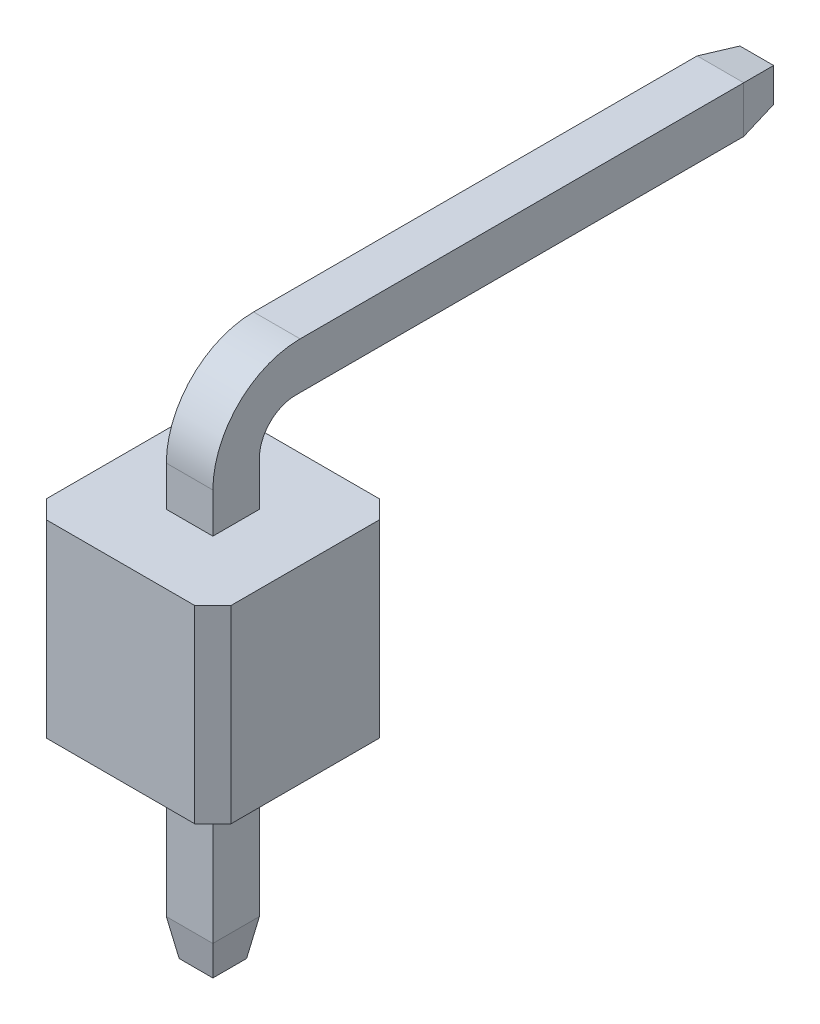
ISO-10303-21;
HEADER;
FILE_DESCRIPTION(('STEP AP214'),'2;1');
FILE_NAME('part.step','',(''),(''),'','','');
FILE_SCHEMA(('AUTOMOTIVE_DESIGN { 1 0 10303 214 1 1 1 1 }'));
ENDSEC;
DATA;
#1=APPLICATION_CONTEXT('core data for automotive mechanical design processes');
#2=APPLICATION_PROTOCOL_DEFINITION('international standard','automotive_design',2000,#1);
#3=PRODUCT_CONTEXT('',#1,'mechanical');
#4=PRODUCT('Part','Part','',(#3));
#5=PRODUCT_RELATED_PRODUCT_CATEGORY('part','',(#4));
#6=PRODUCT_DEFINITION_FORMATION('','',#4);
#7=PRODUCT_DEFINITION_CONTEXT('part definition',#1,'design');
#8=PRODUCT_DEFINITION('design','',#6,#7);
#9=PRODUCT_DEFINITION_SHAPE('','',#8);
#10=(LENGTH_UNIT() NAMED_UNIT(*) SI_UNIT(.MILLI.,.METRE.));
#11=(NAMED_UNIT(*) PLANE_ANGLE_UNIT() SI_UNIT($,.RADIAN.));
#12=(NAMED_UNIT(*) SI_UNIT($,.STERADIAN.) SOLID_ANGLE_UNIT());
#13=UNCERTAINTY_MEASURE_WITH_UNIT(LENGTH_MEASURE(1.E-05),#10,'distance_accuracy_value','');
#14=(GEOMETRIC_REPRESENTATION_CONTEXT(3) GLOBAL_UNCERTAINTY_ASSIGNED_CONTEXT((#13)) GLOBAL_UNIT_ASSIGNED_CONTEXT((#10,
#11,#12)) REPRESENTATION_CONTEXT('',''));
#15=CARTESIAN_POINT('',(0.,0.,0.));
#16=DIRECTION('',(0.,0.,1.));
#17=DIRECTION('',(1.,0.,0.));
#18=AXIS2_PLACEMENT_3D('',#15,#16,#17);
#19=CARTESIAN_POINT('',(0.,2.6,1.27));
#20=DIRECTION('',(0.,0.,-1.));
#21=DIRECTION('',(-1.,0.,0.));
#22=AXIS2_PLACEMENT_3D('',#19,#20,#21);
#23=PLANE('',#22);
#24=DIRECTION('',(1.,0.,0.));
#25=VECTOR('',#24,1.);
#26=CARTESIAN_POINT('',(0.,2.6,1.27));
#27=LINE('',#26,#25);
#28=CARTESIAN_POINT('',(-1.02,2.6,1.27));
#29=VERTEX_POINT('',#28);
#30=CARTESIAN_POINT('',(1.02,2.6,1.27));
#31=VERTEX_POINT('',#30);
#32=EDGE_CURVE('P0_E153',#29,#31,#27,.T.);
#33=ORIENTED_EDGE('',*,*,#32,.F.);
#34=DIRECTION('',(0.,-1.,0.));
#35=VECTOR('',#34,1.);
#36=CARTESIAN_POINT('',(-1.02,0.,1.27));
#37=LINE('',#36,#35);
#38=CARTESIAN_POINT('',(-1.02,0.,1.27));
#39=VERTEX_POINT('',#38);
#40=EDGE_CURVE('P0_E209',#29,#39,#37,.T.);
#41=ORIENTED_EDGE('',*,*,#40,.T.);
#42=DIRECTION('',(1.,0.,0.));
#43=VECTOR('',#42,1.);
#44=CARTESIAN_POINT('',(0.,0.,1.27));
#45=LINE('',#44,#43);
#46=CARTESIAN_POINT('',(1.02,0.,1.27));
#47=VERTEX_POINT('',#46);
#48=EDGE_CURVE('P0_E166',#39,#47,#45,.T.);
#49=ORIENTED_EDGE('',*,*,#48,.T.);
#50=DIRECTION('',(0.,1.,0.));
#51=VECTOR('',#50,1.);
#52=CARTESIAN_POINT('',(1.02,2.6,1.27));
#53=LINE('',#52,#51);
#54=EDGE_CURVE('P0_E207',#47,#31,#53,.T.);
#55=ORIENTED_EDGE('',*,*,#54,.T.);
#56=EDGE_LOOP('',(#33,#41,#49,#55));
#57=FACE_BOUND('',#56,.T.);
#58=ADVANCED_FACE('P0_F17',(#57),#23,.F.);
#59=CARTESIAN_POINT('',(1.27,2.6,0.));
#60=DIRECTION('',(-1.,0.,0.));
#61=DIRECTION('',(0.,0.,1.));
#62=AXIS2_PLACEMENT_3D('',#59,#60,#61);
#63=PLANE('',#62);
#64=DIRECTION('',(0.,0.,-1.));
#65=VECTOR('',#64,1.);
#66=CARTESIAN_POINT('',(1.27,0.,0.));
#67=LINE('',#66,#65);
#68=CARTESIAN_POINT('',(1.27,0.,1.02));
#69=VERTEX_POINT('',#68);
#70=CARTESIAN_POINT('',(1.27,0.,-1.02));
#71=VERTEX_POINT('',#70);
#72=EDGE_CURVE('P0_E169',#69,#71,#67,.T.);
#73=ORIENTED_EDGE('',*,*,#72,.T.);
#74=DIRECTION('',(0.,1.,0.));
#75=VECTOR('',#74,1.);
#76=CARTESIAN_POINT('',(1.27,2.6,-1.02));
#77=LINE('',#76,#75);
#78=CARTESIAN_POINT('',(1.27,2.6,-1.02));
#79=VERTEX_POINT('',#78);
#80=EDGE_CURVE('P0_E193',#71,#79,#77,.T.);
#81=ORIENTED_EDGE('',*,*,#80,.T.);
#82=DIRECTION('',(0.,0.,-1.));
#83=VECTOR('',#82,1.);
#84=CARTESIAN_POINT('',(1.27,2.6,0.));
#85=LINE('',#84,#83);
#86=CARTESIAN_POINT('',(1.27,2.6,1.02));
#87=VERTEX_POINT('',#86);
#88=EDGE_CURVE('P0_E156',#87,#79,#85,.T.);
#89=ORIENTED_EDGE('',*,*,#88,.F.);
#90=DIRECTION('',(0.,-1.,0.));
#91=VECTOR('',#90,1.);
#92=CARTESIAN_POINT('',(1.27,2.6,1.02));
#93=LINE('',#92,#91);
#94=EDGE_CURVE('P0_E190',#87,#69,#93,.T.);
#95=ORIENTED_EDGE('',*,*,#94,.T.);
#96=EDGE_LOOP('',(#73,#81,#89,#95));
#97=FACE_BOUND('',#96,.T.);
#98=ADVANCED_FACE('P0_F266',(#97),#63,.F.);
#99=CARTESIAN_POINT('',(0.,2.6,-1.27));
#100=DIRECTION('',(0.,0.,-1.));
#101=DIRECTION('',(-1.,0.,0.));
#102=AXIS2_PLACEMENT_3D('',#99,#100,#101);
#103=PLANE('',#102);
#104=DIRECTION('',(1.,0.,0.));
#105=VECTOR('',#104,1.);
#106=CARTESIAN_POINT('',(0.,2.6,-1.27));
#107=LINE('',#106,#105);
#108=CARTESIAN_POINT('',(-1.02,2.6,-1.27));
#109=VERTEX_POINT('',#108);
#110=CARTESIAN_POINT('',(1.02,2.6,-1.27));
#111=VERTEX_POINT('',#110);
#112=EDGE_CURVE('P0_E160',#109,#111,#107,.T.);
#113=ORIENTED_EDGE('',*,*,#112,.T.);
#114=DIRECTION('',(0.,-1.,0.));
#115=VECTOR('',#114,1.);
#116=CARTESIAN_POINT('',(1.02,0.,-1.27));
#117=LINE('',#116,#115);
#118=CARTESIAN_POINT('',(1.02,0.,-1.27));
#119=VERTEX_POINT('',#118);
#120=EDGE_CURVE('P0_E179',#111,#119,#117,.T.);
#121=ORIENTED_EDGE('',*,*,#120,.T.);
#122=DIRECTION('',(1.,0.,0.));
#123=VECTOR('',#122,1.);
#124=CARTESIAN_POINT('',(0.,0.,-1.27));
#125=LINE('',#124,#123);
#126=CARTESIAN_POINT('',(-1.02,0.,-1.27));
#127=VERTEX_POINT('',#126);
#128=EDGE_CURVE('P0_E173',#127,#119,#125,.T.);
#129=ORIENTED_EDGE('',*,*,#128,.F.);
#130=DIRECTION('',(0.,1.,0.));
#131=VECTOR('',#130,1.);
#132=CARTESIAN_POINT('',(-1.02,2.6,-1.27));
#133=LINE('',#132,#131);
#134=EDGE_CURVE('P0_E165',#127,#109,#133,.T.);
#135=ORIENTED_EDGE('',*,*,#134,.T.);
#136=EDGE_LOOP('',(#113,#121,#129,#135));
#137=FACE_BOUND('',#136,.T.);
#138=ADVANCED_FACE('P0_F272',(#137),#103,.T.);
#139=CARTESIAN_POINT('',(-1.27,2.6,0.));
#140=DIRECTION('',(-1.,0.,0.));
#141=DIRECTION('',(0.,0.,1.));
#142=AXIS2_PLACEMENT_3D('',#139,#140,#141);
#143=PLANE('',#142);
#144=DIRECTION('',(0.,0.,-1.));
#145=VECTOR('',#144,1.);
#146=CARTESIAN_POINT('',(-1.27,2.6,0.));
#147=LINE('',#146,#145);
#148=CARTESIAN_POINT('',(-1.27,2.6,1.02));
#149=VERTEX_POINT('',#148);
#150=CARTESIAN_POINT('',(-1.27,2.6,-1.02));
#151=VERTEX_POINT('',#150);
#152=EDGE_CURVE('P0_E163',#149,#151,#147,.T.);
#153=ORIENTED_EDGE('',*,*,#152,.T.);
#154=DIRECTION('',(0.,-1.,0.));
#155=VECTOR('',#154,1.);
#156=CARTESIAN_POINT('',(-1.27,2.6,-1.02));
#157=LINE('',#156,#155);
#158=CARTESIAN_POINT('',(-1.27,0.,-1.02));
#159=VERTEX_POINT('',#158);
#160=EDGE_CURVE('P0_E204',#151,#159,#157,.T.);
#161=ORIENTED_EDGE('',*,*,#160,.T.);
#162=DIRECTION('',(0.,0.,-1.));
#163=VECTOR('',#162,1.);
#164=CARTESIAN_POINT('',(-1.27,0.,0.));
#165=LINE('',#164,#163);
#166=CARTESIAN_POINT('',(-1.27,0.,1.02));
#167=VERTEX_POINT('',#166);
#168=EDGE_CURVE('P0_E157',#167,#159,#165,.T.);
#169=ORIENTED_EDGE('',*,*,#168,.F.);
#170=DIRECTION('',(0.,1.,0.));
#171=VECTOR('',#170,1.);
#172=CARTESIAN_POINT('',(-1.27,2.6,1.02));
#173=LINE('',#172,#171);
#174=EDGE_CURVE('P0_E202',#167,#149,#173,.T.);
#175=ORIENTED_EDGE('',*,*,#174,.T.);
#176=EDGE_LOOP('',(#153,#161,#169,#175));
#177=FACE_BOUND('',#176,.T.);
#178=ADVANCED_FACE('P0_F311',(#177),#143,.T.);
#179=CARTESIAN_POINT('',(0.,2.6,0.));
#180=DIRECTION('',(0.,1.,0.));
#181=DIRECTION('',(0.,0.,1.));
#182=AXIS2_PLACEMENT_3D('',#179,#180,#181);
#183=PLANE('',#182);
#184=ORIENTED_EDGE('',*,*,#88,.T.);
#185=DIRECTION('',(-0.707106781186546,0.,-0.707106781186549));
#186=VECTOR('',#185,1.);
#187=CARTESIAN_POINT('',(1.145,2.6,-1.145));
#188=LINE('',#187,#186);
#189=EDGE_CURVE('P0_E200',#79,#111,#188,.T.);
#190=ORIENTED_EDGE('',*,*,#189,.T.);
#191=ORIENTED_EDGE('',*,*,#112,.F.);
#192=DIRECTION('',(0.707106781186549,0.,-0.707106781186546));
#193=VECTOR('',#192,1.);
#194=CARTESIAN_POINT('',(-1.145,2.6,-1.145));
#195=LINE('',#194,#193);
#196=EDGE_CURVE('P0_E40',#109,#151,#195,.F.);
#197=ORIENTED_EDGE('',*,*,#196,.T.);
#198=ORIENTED_EDGE('',*,*,#152,.F.);
#199=DIRECTION('',(0.707106781186546,0.,0.707106781186549));
#200=VECTOR('',#199,1.);
#201=CARTESIAN_POINT('',(-1.145,2.6,1.145));
#202=LINE('',#201,#200);
#203=EDGE_CURVE('P0_E197',#149,#29,#202,.T.);
#204=ORIENTED_EDGE('',*,*,#203,.T.);
#205=ORIENTED_EDGE('',*,*,#32,.T.);
#206=DIRECTION('',(-0.707106781186549,0.,0.707106781186546));
#207=VECTOR('',#206,1.);
#208=CARTESIAN_POINT('',(1.145,2.6,1.145));
#209=LINE('',#208,#207);
#210=EDGE_CURVE('P0_E195',#31,#87,#209,.F.);
#211=ORIENTED_EDGE('',*,*,#210,.T.);
#212=EDGE_LOOP('',(#184,#190,#191,#197,#198,#204,#205,#211));
#213=FACE_BOUND('',#212,.T.);
#214=ADVANCED_FACE('P0_F295',(#213),#183,.T.);
#215=CARTESIAN_POINT('',(0.,0.,0.));
#216=DIRECTION('',(0.,1.,0.));
#217=DIRECTION('',(0.,0.,1.));
#218=AXIS2_PLACEMENT_3D('',#215,#216,#217);
#219=PLANE('',#218);
#220=DIRECTION('',(0.,0.,-1.));
#221=VECTOR('',#220,1.);
#222=CARTESIAN_POINT('',(-0.32,0.,0.));
#223=LINE('',#222,#221);
#224=CARTESIAN_POINT('',(-0.32,0.,0.32));
#225=VERTEX_POINT('',#224);
#226=CARTESIAN_POINT('',(-0.32,0.,-0.32));
#227=VERTEX_POINT('',#226);
#228=EDGE_CURVE('P0_E25',#225,#227,#223,.T.);
#229=ORIENTED_EDGE('',*,*,#228,.F.);
#230=DIRECTION('',(1.,0.,0.));
#231=VECTOR('',#230,1.);
#232=CARTESIAN_POINT('',(0.,0.,0.32));
#233=LINE('',#232,#231);
#234=CARTESIAN_POINT('',(0.32,0.,0.32));
#235=VERTEX_POINT('',#234);
#236=EDGE_CURVE('P0_E11',#225,#235,#233,.T.);
#237=ORIENTED_EDGE('',*,*,#236,.T.);
#238=DIRECTION('',(0.,0.,-1.));
#239=VECTOR('',#238,1.);
#240=CARTESIAN_POINT('',(0.32,0.,0.));
#241=LINE('',#240,#239);
#242=CARTESIAN_POINT('',(0.32,0.,-0.32));
#243=VERTEX_POINT('',#242);
#244=EDGE_CURVE('P0_E212',#235,#243,#241,.T.);
#245=ORIENTED_EDGE('',*,*,#244,.T.);
#246=DIRECTION('',(1.,0.,0.));
#247=VECTOR('',#246,1.);
#248=CARTESIAN_POINT('',(0.,0.,-0.32));
#249=LINE('',#248,#247);
#250=EDGE_CURVE('P0_E215',#227,#243,#249,.T.);
#251=ORIENTED_EDGE('',*,*,#250,.F.);
#252=EDGE_LOOP('',(#229,#237,#245,#251));
#253=FACE_BOUND('',#252,.T.);
#254=ORIENTED_EDGE('',*,*,#128,.T.);
#255=DIRECTION('',(0.707106781186546,0.,0.707106781186549));
#256=VECTOR('',#255,1.);
#257=CARTESIAN_POINT('',(1.02,0.,-1.27));
#258=LINE('',#257,#256);
#259=EDGE_CURVE('P0_E188',#119,#71,#258,.T.);
#260=ORIENTED_EDGE('',*,*,#259,.T.);
#261=ORIENTED_EDGE('',*,*,#72,.F.);
#262=DIRECTION('',(0.707106781186549,0.,-0.707106781186546));
#263=VECTOR('',#262,1.);
#264=CARTESIAN_POINT('',(1.27,0.,1.02));
#265=LINE('',#264,#263);
#266=EDGE_CURVE('P0_E182',#69,#47,#265,.F.);
#267=ORIENTED_EDGE('',*,*,#266,.T.);
#268=ORIENTED_EDGE('',*,*,#48,.F.);
#269=DIRECTION('',(-0.707106781186546,0.,-0.707106781186549));
#270=VECTOR('',#269,1.);
#271=CARTESIAN_POINT('',(-1.02,0.,1.27));
#272=LINE('',#271,#270);
#273=EDGE_CURVE('P0_E184',#39,#167,#272,.T.);
#274=ORIENTED_EDGE('',*,*,#273,.T.);
#275=ORIENTED_EDGE('',*,*,#168,.T.);
#276=DIRECTION('',(-0.707106781186549,0.,0.707106781186546));
#277=VECTOR('',#276,1.);
#278=CARTESIAN_POINT('',(-1.27,0.,-1.02));
#279=LINE('',#278,#277);
#280=EDGE_CURVE('P0_E186',#159,#127,#279,.F.);
#281=ORIENTED_EDGE('',*,*,#280,.T.);
#282=EDGE_LOOP('',(#254,#260,#261,#267,#268,#274,#275,#281));
#283=FACE_BOUND('',#282,.T.);
#284=ADVANCED_FACE('P0_F232',(#253,#283),#219,.F.);
#285=CARTESIAN_POINT('',(1.02,2.6,-1.27));
#286=DIRECTION('',(0.707106781186549,0.,-0.707106781186546));
#287=DIRECTION('',(0.,1.,0.));
#288=AXIS2_PLACEMENT_3D('',#285,#286,#287);
#289=PLANE('',#288);
#290=ORIENTED_EDGE('',*,*,#189,.F.);
#291=ORIENTED_EDGE('',*,*,#80,.F.);
#292=ORIENTED_EDGE('',*,*,#259,.F.);
#293=ORIENTED_EDGE('',*,*,#120,.F.);
#294=EDGE_LOOP('',(#290,#291,#292,#293));
#295=FACE_BOUND('',#294,.T.);
#296=ADVANCED_FACE('P0_F278',(#295),#289,.T.);
#297=CARTESIAN_POINT('',(-1.27,2.6,-1.02));
#298=DIRECTION('',(0.707106781186546,0.,0.707106781186549));
#299=DIRECTION('',(0.,-1.,0.));
#300=AXIS2_PLACEMENT_3D('',#297,#298,#299);
#301=PLANE('',#300);
#302=ORIENTED_EDGE('',*,*,#196,.F.);
#303=ORIENTED_EDGE('',*,*,#134,.F.);
#304=ORIENTED_EDGE('',*,*,#280,.F.);
#305=ORIENTED_EDGE('',*,*,#160,.F.);
#306=EDGE_LOOP('',(#302,#303,#304,#305));
#307=FACE_BOUND('',#306,.T.);
#308=ADVANCED_FACE('P0_F281',(#307),#301,.F.);
#309=CARTESIAN_POINT('',(-1.02,2.6,1.27));
#310=DIRECTION('',(-0.707106781186549,0.,0.707106781186546));
#311=DIRECTION('',(0.,1.,0.));
#312=AXIS2_PLACEMENT_3D('',#309,#310,#311);
#313=PLANE('',#312);
#314=ORIENTED_EDGE('',*,*,#203,.F.);
#315=ORIENTED_EDGE('',*,*,#174,.F.);
#316=ORIENTED_EDGE('',*,*,#273,.F.);
#317=ORIENTED_EDGE('',*,*,#40,.F.);
#318=EDGE_LOOP('',(#314,#315,#316,#317));
#319=FACE_BOUND('',#318,.T.);
#320=ADVANCED_FACE('P0_F284',(#319),#313,.T.);
#321=CARTESIAN_POINT('',(1.27,2.6,1.02));
#322=DIRECTION('',(-0.707106781186546,0.,-0.707106781186549));
#323=DIRECTION('',(0.,-1.,0.));
#324=AXIS2_PLACEMENT_3D('',#321,#322,#323);
#325=PLANE('',#324);
#326=ORIENTED_EDGE('',*,*,#210,.F.);
#327=ORIENTED_EDGE('',*,*,#54,.F.);
#328=ORIENTED_EDGE('',*,*,#266,.F.);
#329=ORIENTED_EDGE('',*,*,#94,.F.);
#330=EDGE_LOOP('',(#326,#327,#328,#329));
#331=FACE_BOUND('',#330,.T.);
#332=ADVANCED_FACE('P0_F19',(#331),#325,.F.);
#333=CARTESIAN_POINT('',(0.,-2.75,0.));
#334=DIRECTION('',(0.,1.,0.));
#335=DIRECTION('',(0.,0.,1.));
#336=AXIS2_PLACEMENT_3D('',#333,#334,#335);
#337=PLANE('',#336);
#338=DIRECTION('',(0.,0.,-1.));
#339=VECTOR('',#338,1.);
#340=CARTESIAN_POINT('',(-0.231836509645768,-2.75,0.));
#341=LINE('',#340,#339);
#342=CARTESIAN_POINT('',(-0.231836509645768,-2.75,0.231836509645769));
#343=VERTEX_POINT('',#342);
#344=CARTESIAN_POINT('',(-0.231836509645768,-2.75,-0.231836509645766));
#345=VERTEX_POINT('',#344);
#346=EDGE_CURVE('P0_E130',#343,#345,#341,.T.);
#347=ORIENTED_EDGE('',*,*,#346,.T.);
#348=DIRECTION('',(1.,0.,0.));
#349=VECTOR('',#348,1.);
#350=CARTESIAN_POINT('',(0.,-2.75,-0.231836509645766));
#351=LINE('',#350,#349);
#352=CARTESIAN_POINT('',(0.231836509645768,-2.75,-0.231836509645766));
#353=VERTEX_POINT('',#352);
#354=EDGE_CURVE('P0_E126',#345,#353,#351,.T.);
#355=ORIENTED_EDGE('',*,*,#354,.T.);
#356=DIRECTION('',(0.,0.,1.));
#357=VECTOR('',#356,1.);
#358=CARTESIAN_POINT('',(0.231836509645768,-2.75,0.32));
#359=LINE('',#358,#357);
#360=CARTESIAN_POINT('',(0.231836509645768,-2.75,0.231836509645769));
#361=VERTEX_POINT('',#360);
#362=EDGE_CURVE('P0_E120',#353,#361,#359,.T.);
#363=ORIENTED_EDGE('',*,*,#362,.T.);
#364=DIRECTION('',(-1.,0.,0.));
#365=VECTOR('',#364,1.);
#366=CARTESIAN_POINT('',(-0.32,-2.75,0.231836509645769));
#367=LINE('',#366,#365);
#368=EDGE_CURVE('P0_E123',#361,#343,#367,.T.);
#369=ORIENTED_EDGE('',*,*,#368,.T.);
#370=EDGE_LOOP('',(#347,#355,#363,#369));
#371=FACE_BOUND('',#370,.T.);
#372=ADVANCED_FACE('P0_F122',(#371),#337,.F.);
#373=CARTESIAN_POINT('',(-0.32,-2.25,0.32));
#374=DIRECTION('',(0.,-0.173648177666927,0.984807753012209));
#375=DIRECTION('',(-1.,0.,0.));
#376=AXIS2_PLACEMENT_3D('',#373,#374,#375);
#377=PLANE('',#376);
#378=DIRECTION('',(0.171087869746033,0.970287525247815,0.171087869746033));
#379=VECTOR('',#378,1.);
#380=CARTESIAN_POINT('',(0.301266522128489,-2.35624283247091,0.30126652212849));
#381=LINE('',#380,#379);
#382=CARTESIAN_POINT('',(0.32,-2.25,0.32));
#383=VERTEX_POINT('',#382);
#384=EDGE_CURVE('P0_E136',#383,#361,#381,.F.);
#385=ORIENTED_EDGE('',*,*,#384,.F.);
#386=DIRECTION('',(1.,0.,0.));
#387=VECTOR('',#386,1.);
#388=CARTESIAN_POINT('',(0.32,-2.25,0.32));
#389=LINE('',#388,#387);
#390=CARTESIAN_POINT('',(-0.32,-2.25,0.32));
#391=VERTEX_POINT('',#390);
#392=EDGE_CURVE('P0_E170',#391,#383,#389,.T.);
#393=ORIENTED_EDGE('',*,*,#392,.F.);
#394=DIRECTION('',(-0.171087869746033,0.970287525247815,0.171087869746033));
#395=VECTOR('',#394,1.);
#396=CARTESIAN_POINT('',(-0.32,-2.25,0.32));
#397=LINE('',#396,#395);
#398=EDGE_CURVE('P0_E139',#343,#391,#397,.T.);
#399=ORIENTED_EDGE('',*,*,#398,.F.);
#400=ORIENTED_EDGE('',*,*,#368,.F.);
#401=EDGE_LOOP('',(#385,#393,#399,#400));
#402=FACE_BOUND('',#401,.T.);
#403=ADVANCED_FACE('P0_F134',(#402),#377,.T.);
#404=CARTESIAN_POINT('',(-0.231836509645768,-2.75,0.));
#405=DIRECTION('',(0.984807753012209,0.173648177666927,0.));
#406=DIRECTION('',(0.,0.,-1.));
#407=AXIS2_PLACEMENT_3D('',#404,#405,#406);
#408=PLANE('',#407);
#409=ORIENTED_EDGE('',*,*,#398,.T.);
#410=DIRECTION('',(0.,0.,1.));
#411=VECTOR('',#410,1.);
#412=CARTESIAN_POINT('',(-0.32,-2.25,0.32));
#413=LINE('',#412,#411);
#414=CARTESIAN_POINT('',(-0.32,-2.25,-0.32));
#415=VERTEX_POINT('',#414);
#416=EDGE_CURVE('P0_E246',#415,#391,#413,.T.);
#417=ORIENTED_EDGE('',*,*,#416,.F.);
#418=DIRECTION('',(0.171087869746033,-0.970287525247815,0.171087869746033));
#419=VECTOR('',#418,1.);
#420=CARTESIAN_POINT('',(-0.225050409453179,-2.78848588664833,-0.225050409453178));
#421=LINE('',#420,#419);
#422=EDGE_CURVE('P0_E145',#345,#415,#421,.F.);
#423=ORIENTED_EDGE('',*,*,#422,.F.);
#424=ORIENTED_EDGE('',*,*,#346,.F.);
#425=EDGE_LOOP('',(#409,#417,#423,#424));
#426=FACE_BOUND('',#425,.T.);
#427=ADVANCED_FACE('P0_F253',(#426),#408,.F.);
#428=CARTESIAN_POINT('',(0.,-2.75,-0.231836509645766));
#429=DIRECTION('',(0.,0.173648177666927,0.984807753012209));
#430=DIRECTION('',(1.,0.,0.));
#431=AXIS2_PLACEMENT_3D('',#428,#429,#430);
#432=PLANE('',#431);
#433=ORIENTED_EDGE('',*,*,#422,.T.);
#434=DIRECTION('',(-1.,0.,0.));
#435=VECTOR('',#434,1.);
#436=CARTESIAN_POINT('',(-0.32,-2.25,-0.32));
#437=LINE('',#436,#435);
#438=CARTESIAN_POINT('',(0.32,-2.25,-0.32));
#439=VERTEX_POINT('',#438);
#440=EDGE_CURVE('P0_E230',#439,#415,#437,.T.);
#441=ORIENTED_EDGE('',*,*,#440,.F.);
#442=DIRECTION('',(-0.171087869746033,-0.970287525247815,0.171087869746033));
#443=VECTOR('',#442,1.);
#444=CARTESIAN_POINT('',(0.301266522128489,-2.35624283247091,-0.301266522128488));
#445=LINE('',#444,#443);
#446=EDGE_CURVE('P0_E149',#439,#353,#445,.T.);
#447=ORIENTED_EDGE('',*,*,#446,.T.);
#448=ORIENTED_EDGE('',*,*,#354,.F.);
#449=EDGE_LOOP('',(#433,#441,#447,#448));
#450=FACE_BOUND('',#449,.T.);
#451=ADVANCED_FACE('P0_F249',(#450),#432,.F.);
#452=CARTESIAN_POINT('',(0.32,-2.25,0.32));
#453=DIRECTION('',(0.984807753012209,-0.173648177666927,0.));
#454=DIRECTION('',(0.,0.,1.));
#455=AXIS2_PLACEMENT_3D('',#452,#453,#454);
#456=PLANE('',#455);
#457=ORIENTED_EDGE('',*,*,#384,.T.);
#458=ORIENTED_EDGE('',*,*,#362,.F.);
#459=ORIENTED_EDGE('',*,*,#446,.F.);
#460=DIRECTION('',(0.,0.,-1.));
#461=VECTOR('',#460,1.);
#462=CARTESIAN_POINT('',(0.32,-2.25,-0.32));
#463=LINE('',#462,#461);
#464=EDGE_CURVE('P0_E144',#383,#439,#463,.T.);
#465=ORIENTED_EDGE('',*,*,#464,.F.);
#466=EDGE_LOOP('',(#457,#458,#459,#465));
#467=FACE_BOUND('',#466,.T.);
#468=ADVANCED_FACE('P0_F143',(#467),#456,.T.);
#469=CARTESIAN_POINT('',(0.32,-2.75,0.32));
#470=DIRECTION('',(1.,0.,0.));
#471=DIRECTION('',(0.,0.,-1.));
#472=AXIS2_PLACEMENT_3D('',#469,#470,#471);
#473=PLANE('',#472);
#474=ORIENTED_EDGE('',*,*,#244,.F.);
#475=DIRECTION('',(0.,1.,0.));
#476=VECTOR('',#475,1.);
#477=CARTESIAN_POINT('',(0.32,-2.75,0.32));
#478=LINE('',#477,#476);
#479=EDGE_CURVE('P0_E147',#383,#235,#478,.T.);
#480=ORIENTED_EDGE('',*,*,#479,.F.);
#481=ORIENTED_EDGE('',*,*,#464,.T.);
#482=DIRECTION('',(0.,1.,0.));
#483=VECTOR('',#482,1.);
#484=CARTESIAN_POINT('',(0.32,-2.75,-0.32));
#485=LINE('',#484,#483);
#486=EDGE_CURVE('P0_E32',#439,#243,#485,.T.);
#487=ORIENTED_EDGE('',*,*,#486,.T.);
#488=EDGE_LOOP('',(#474,#480,#481,#487));
#489=FACE_BOUND('',#488,.T.);
#490=ADVANCED_FACE('P0_F236',(#489),#473,.T.);
#491=CARTESIAN_POINT('',(-0.32,-2.75,-0.32));
#492=DIRECTION('',(0.,0.,1.));
#493=DIRECTION('',(1.,0.,0.));
#494=AXIS2_PLACEMENT_3D('',#491,#492,#493);
#495=PLANE('',#494);
#496=DIRECTION('',(0.,1.,0.));
#497=VECTOR('',#496,1.);
#498=CARTESIAN_POINT('',(-0.32,-2.75,-0.32));
#499=LINE('',#498,#497);
#500=EDGE_CURVE('P0_E222',#415,#227,#499,.T.);
#501=ORIENTED_EDGE('',*,*,#500,.T.);
#502=ORIENTED_EDGE('',*,*,#250,.T.);
#503=ORIENTED_EDGE('',*,*,#486,.F.);
#504=ORIENTED_EDGE('',*,*,#440,.T.);
#505=EDGE_LOOP('',(#501,#502,#503,#504));
#506=FACE_BOUND('',#505,.T.);
#507=ADVANCED_FACE('P0_F228',(#506),#495,.F.);
#508=CARTESIAN_POINT('',(-0.32,-2.75,0.32));
#509=DIRECTION('',(1.,0.,0.));
#510=DIRECTION('',(0.,0.,-1.));
#511=AXIS2_PLACEMENT_3D('',#508,#509,#510);
#512=PLANE('',#511);
#513=DIRECTION('',(0.,1.,0.));
#514=VECTOR('',#513,1.);
#515=CARTESIAN_POINT('',(-0.32,-2.75,0.32));
#516=LINE('',#515,#514);
#517=EDGE_CURVE('P0_E141',#391,#225,#516,.T.);
#518=ORIENTED_EDGE('',*,*,#517,.T.);
#519=ORIENTED_EDGE('',*,*,#228,.T.);
#520=ORIENTED_EDGE('',*,*,#500,.F.);
#521=ORIENTED_EDGE('',*,*,#416,.T.);
#522=EDGE_LOOP('',(#518,#519,#520,#521));
#523=FACE_BOUND('',#522,.T.);
#524=ADVANCED_FACE('P0_F221',(#523),#512,.F.);
#525=CARTESIAN_POINT('',(-0.32,-2.75,0.32));
#526=DIRECTION('',(0.,0.,1.));
#527=DIRECTION('',(1.,0.,0.));
#528=AXIS2_PLACEMENT_3D('',#525,#526,#527);
#529=PLANE('',#528);
#530=ORIENTED_EDGE('',*,*,#236,.F.);
#531=ORIENTED_EDGE('',*,*,#517,.F.);
#532=ORIENTED_EDGE('',*,*,#392,.T.);
#533=ORIENTED_EDGE('',*,*,#479,.T.);
#534=EDGE_LOOP('',(#530,#531,#532,#533));
#535=FACE_BOUND('',#534,.T.);
#536=ADVANCED_FACE('P0_F238',(#535),#529,.T.);
#537=CLOSED_SHELL('',(#58,#98,#138,#178,#214,#284,#296,#308,#320,#332,#372,#403,#427,#451,#468,
#490,#507,#524,#536));
#538=MANIFOLD_SOLID_BREP('P0_B1',#537);
#539=CARTESIAN_POINT('',(0.32,4.35,-7.48));
#540=DIRECTION('',(0.,0.,1.));
#541=DIRECTION('',(1.,0.,0.));
#542=AXIS2_PLACEMENT_3D('',#539,#540,#541);
#543=PLANE('',#542);
#544=DIRECTION('',(0.,-1.,0.));
#545=VECTOR('',#544,1.);
#546=CARTESIAN_POINT('',(0.231836509645767,4.35,-7.48));
#547=LINE('',#546,#545);
#548=CARTESIAN_POINT('',(0.231836509645767,4.26183650964577,-7.48));
#549=VERTEX_POINT('',#548);
#550=CARTESIAN_POINT('',(0.231836509645767,3.79816349035423,-7.48));
#551=VERTEX_POINT('',#550);
#552=EDGE_CURVE('P1_E153',#549,#551,#547,.T.);
#553=ORIENTED_EDGE('',*,*,#552,.T.);
#554=DIRECTION('',(-1.,0.,0.));
#555=VECTOR('',#554,1.);
#556=CARTESIAN_POINT('',(0.32,3.79816349035423,-7.48));
#557=LINE('',#556,#555);
#558=CARTESIAN_POINT('',(-0.231836509645767,3.79816349035423,-7.48));
#559=VERTEX_POINT('',#558);
#560=EDGE_CURVE('P1_E155',#551,#559,#557,.T.);
#561=ORIENTED_EDGE('',*,*,#560,.T.);
#562=DIRECTION('',(0.,1.,0.));
#563=VECTOR('',#562,1.);
#564=CARTESIAN_POINT('',(-0.231836509645767,4.35,-7.48));
#565=LINE('',#564,#563);
#566=CARTESIAN_POINT('',(-0.231836509645767,4.26183650964577,-7.48));
#567=VERTEX_POINT('',#566);
#568=EDGE_CURVE('P1_E106',#559,#567,#565,.T.);
#569=ORIENTED_EDGE('',*,*,#568,.T.);
#570=DIRECTION('',(1.,0.,0.));
#571=VECTOR('',#570,1.);
#572=CARTESIAN_POINT('',(0.32,4.26183650964577,-7.48));
#573=LINE('',#572,#571);
#574=EDGE_CURVE('P1_E151',#567,#549,#573,.T.);
#575=ORIENTED_EDGE('',*,*,#574,.T.);
#576=EDGE_LOOP('',(#553,#561,#569,#575));
#577=FACE_BOUND('',#576,.T.);
#578=ADVANCED_FACE('P1_F17',(#577),#543,.F.);
#579=CARTESIAN_POINT('',(0.32,4.35,-0.88));
#580=DIRECTION('',(0.,-1.,0.));
#581=DIRECTION('',(0.,0.,-1.));
#582=AXIS2_PLACEMENT_3D('',#579,#580,#581);
#583=PLANE('',#582);
#584=DIRECTION('',(0.,0.,1.));
#585=VECTOR('',#584,1.);
#586=CARTESIAN_POINT('',(0.32,4.35,-0.88));
#587=LINE('',#586,#585);
#588=CARTESIAN_POINT('',(0.32,4.35,-6.98));
#589=VERTEX_POINT('',#588);
#590=CARTESIAN_POINT('',(0.32,4.35,-0.88));
#591=VERTEX_POINT('',#590);
#592=EDGE_CURVE('P1_E92',#589,#591,#587,.T.);
#593=ORIENTED_EDGE('',*,*,#592,.F.);
#594=DIRECTION('',(-1.,0.,0.));
#595=VECTOR('',#594,1.);
#596=CARTESIAN_POINT('',(0.32,4.35,-6.98));
#597=LINE('',#596,#595);
#598=CARTESIAN_POINT('',(-0.32,4.35,-6.98));
#599=VERTEX_POINT('',#598);
#600=EDGE_CURVE('P1_E26',#589,#599,#597,.T.);
#601=ORIENTED_EDGE('',*,*,#600,.T.);
#602=DIRECTION('',(0.,0.,1.));
#603=VECTOR('',#602,1.);
#604=CARTESIAN_POINT('',(-0.32,4.35,-0.88));
#605=LINE('',#604,#603);
#606=CARTESIAN_POINT('',(-0.32,4.35,-0.88));
#607=VERTEX_POINT('',#606);
#608=EDGE_CURVE('P1_E103',#599,#607,#605,.T.);
#609=ORIENTED_EDGE('',*,*,#608,.T.);
#610=DIRECTION('',(-1.,0.,0.));
#611=VECTOR('',#610,1.);
#612=CARTESIAN_POINT('',(0.32,4.35,-0.88));
#613=LINE('',#612,#611);
#614=EDGE_CURVE('P1_E101',#591,#607,#613,.T.);
#615=ORIENTED_EDGE('',*,*,#614,.F.);
#616=EDGE_LOOP('',(#593,#601,#609,#615));
#617=FACE_BOUND('',#616,.T.);
#618=ADVANCED_FACE('P1_F102',(#617),#583,.F.);
#619=CARTESIAN_POINT('',(0.32,3.15,-0.88));
#620=DIRECTION('',(-1.,0.,0.));
#621=DIRECTION('',(0.,0.,1.));
#622=AXIS2_PLACEMENT_3D('',#619,#620,#621);
#623=CYLINDRICAL_SURFACE('',#622,1.2);
#624=CARTESIAN_POINT('',(-0.32,3.15,-0.88));
#625=DIRECTION('',(1.,0.,0.));
#626=DIRECTION('',(0.,0.,1.));
#627=AXIS2_PLACEMENT_3D('',#624,#625,#626);
#628=CIRCLE('',#627,1.2);
#629=CARTESIAN_POINT('',(-0.32,3.15,0.32));
#630=VERTEX_POINT('',#629);
#631=EDGE_CURVE('P1_E126',#607,#630,#628,.T.);
#632=ORIENTED_EDGE('',*,*,#631,.T.);
#633=DIRECTION('',(-1.,0.,0.));
#634=VECTOR('',#633,1.);
#635=CARTESIAN_POINT('',(0.32,3.15,0.32));
#636=LINE('',#635,#634);
#637=CARTESIAN_POINT('',(0.32,3.15,0.32));
#638=VERTEX_POINT('',#637);
#639=EDGE_CURVE('P1_E107',#638,#630,#636,.T.);
#640=ORIENTED_EDGE('',*,*,#639,.F.);
#641=CARTESIAN_POINT('',(0.32,3.15,-0.88));
#642=DIRECTION('',(1.,0.,0.));
#643=DIRECTION('',(0.,0.,1.));
#644=AXIS2_PLACEMENT_3D('',#641,#642,#643);
#645=CIRCLE('',#644,1.2);
#646=EDGE_CURVE('P1_E96',#591,#638,#645,.T.);
#647=ORIENTED_EDGE('',*,*,#646,.F.);
#648=ORIENTED_EDGE('',*,*,#614,.T.);
#649=EDGE_LOOP('',(#632,#640,#647,#648));
#650=FACE_BOUND('',#649,.T.);
#651=ADVANCED_FACE('P1_F109',(#650),#623,.T.);
#652=CARTESIAN_POINT('',(0.32,2.6,0.32));
#653=DIRECTION('',(0.,0.,-1.));
#654=DIRECTION('',(-1.,0.,0.));
#655=AXIS2_PLACEMENT_3D('',#652,#653,#654);
#656=PLANE('',#655);
#657=DIRECTION('',(0.,-1.,0.));
#658=VECTOR('',#657,1.);
#659=CARTESIAN_POINT('',(-0.32,2.6,0.32));
#660=LINE('',#659,#658);
#661=CARTESIAN_POINT('',(-0.32,2.6,0.32));
#662=VERTEX_POINT('',#661);
#663=EDGE_CURVE('P1_E128',#630,#662,#660,.T.);
#664=ORIENTED_EDGE('',*,*,#663,.T.);
#665=DIRECTION('',(-1.,0.,0.));
#666=VECTOR('',#665,1.);
#667=CARTESIAN_POINT('',(0.32,2.6,0.32));
#668=LINE('',#667,#666);
#669=CARTESIAN_POINT('',(0.32,2.6,0.32));
#670=VERTEX_POINT('',#669);
#671=EDGE_CURVE('P1_E146',#670,#662,#668,.T.);
#672=ORIENTED_EDGE('',*,*,#671,.F.);
#673=DIRECTION('',(0.,-1.,0.));
#674=VECTOR('',#673,1.);
#675=CARTESIAN_POINT('',(0.32,2.6,0.32));
#676=LINE('',#675,#674);
#677=EDGE_CURVE('P1_E112',#638,#670,#676,.T.);
#678=ORIENTED_EDGE('',*,*,#677,.F.);
#679=ORIENTED_EDGE('',*,*,#639,.T.);
#680=EDGE_LOOP('',(#664,#672,#678,#679));
#681=FACE_BOUND('',#680,.T.);
#682=ADVANCED_FACE('P1_F233',(#681),#656,.F.);
#683=CARTESIAN_POINT('',(0.32,2.6,0.32));
#684=DIRECTION('',(0.,1.,0.));
#685=DIRECTION('',(0.,0.,1.));
#686=AXIS2_PLACEMENT_3D('',#683,#684,#685);
#687=PLANE('',#686);
#688=DIRECTION('',(0.,0.,-1.));
#689=VECTOR('',#688,1.);
#690=CARTESIAN_POINT('',(-0.32,2.6,0.32));
#691=LINE('',#690,#689);
#692=CARTESIAN_POINT('',(-0.32,2.6,-0.32));
#693=VERTEX_POINT('',#692);
#694=EDGE_CURVE('P1_E130',#662,#693,#691,.T.);
#695=ORIENTED_EDGE('',*,*,#694,.T.);
#696=DIRECTION('',(-1.,0.,0.));
#697=VECTOR('',#696,1.);
#698=CARTESIAN_POINT('',(0.32,2.6,-0.32));
#699=LINE('',#698,#697);
#700=CARTESIAN_POINT('',(0.32,2.6,-0.32));
#701=VERTEX_POINT('',#700);
#702=EDGE_CURVE('P1_E143',#701,#693,#699,.T.);
#703=ORIENTED_EDGE('',*,*,#702,.F.);
#704=DIRECTION('',(0.,0.,-1.));
#705=VECTOR('',#704,1.);
#706=CARTESIAN_POINT('',(0.32,2.6,0.32));
#707=LINE('',#706,#705);
#708=EDGE_CURVE('P1_E114',#670,#701,#707,.T.);
#709=ORIENTED_EDGE('',*,*,#708,.F.);
#710=ORIENTED_EDGE('',*,*,#671,.T.);
#711=EDGE_LOOP('',(#695,#703,#709,#710));
#712=FACE_BOUND('',#711,.T.);
#713=ADVANCED_FACE('P1_F229',(#712),#687,.F.);
#714=CARTESIAN_POINT('',(0.32,3.21,-0.32));
#715=DIRECTION('',(0.,0.,1.));
#716=DIRECTION('',(0.,-1.,0.));
#717=AXIS2_PLACEMENT_3D('',#714,#715,#716);
#718=PLANE('',#717);
#719=DIRECTION('',(0.,1.,0.));
#720=VECTOR('',#719,1.);
#721=CARTESIAN_POINT('',(-0.32,3.21,-0.32));
#722=LINE('',#721,#720);
#723=CARTESIAN_POINT('',(-0.32,3.21,-0.32));
#724=VERTEX_POINT('',#723);
#725=EDGE_CURVE('P1_E132',#693,#724,#722,.T.);
#726=ORIENTED_EDGE('',*,*,#725,.T.);
#727=DIRECTION('',(-1.,0.,0.));
#728=VECTOR('',#727,1.);
#729=CARTESIAN_POINT('',(0.32,3.21,-0.32));
#730=LINE('',#729,#728);
#731=CARTESIAN_POINT('',(0.32,3.21,-0.32));
#732=VERTEX_POINT('',#731);
#733=EDGE_CURVE('P1_E140',#732,#724,#730,.T.);
#734=ORIENTED_EDGE('',*,*,#733,.F.);
#735=DIRECTION('',(0.,1.,0.));
#736=VECTOR('',#735,1.);
#737=CARTESIAN_POINT('',(0.32,3.21,-0.32));
#738=LINE('',#737,#736);
#739=EDGE_CURVE('P1_E118',#701,#732,#738,.T.);
#740=ORIENTED_EDGE('',*,*,#739,.F.);
#741=ORIENTED_EDGE('',*,*,#702,.T.);
#742=EDGE_LOOP('',(#726,#734,#740,#741));
#743=FACE_BOUND('',#742,.T.);
#744=ADVANCED_FACE('P1_F225',(#743),#718,.F.);
#745=CARTESIAN_POINT('',(0.32,3.21,-0.82));
#746=DIRECTION('',(-1.,0.,0.));
#747=DIRECTION('',(0.,0.,1.));
#748=AXIS2_PLACEMENT_3D('',#745,#746,#747);
#749=CYLINDRICAL_SURFACE('',#748,0.5);
#750=CARTESIAN_POINT('',(-0.32,3.21,-0.82));
#751=DIRECTION('',(-1.,0.,0.));
#752=DIRECTION('',(0.,0.,1.));
#753=AXIS2_PLACEMENT_3D('',#750,#751,#752);
#754=CIRCLE('',#753,0.5);
#755=CARTESIAN_POINT('',(-0.32,3.71,-0.82));
#756=VERTEX_POINT('',#755);
#757=EDGE_CURVE('P1_E134',#724,#756,#754,.T.);
#758=ORIENTED_EDGE('',*,*,#757,.T.);
#759=DIRECTION('',(-1.,0.,0.));
#760=VECTOR('',#759,1.);
#761=CARTESIAN_POINT('',(0.32,3.71,-0.82));
#762=LINE('',#761,#760);
#763=CARTESIAN_POINT('',(0.32,3.71,-0.82));
#764=VERTEX_POINT('',#763);
#765=EDGE_CURVE('P1_E124',#764,#756,#762,.T.);
#766=ORIENTED_EDGE('',*,*,#765,.F.);
#767=CARTESIAN_POINT('',(0.32,3.21,-0.82));
#768=DIRECTION('',(-1.,0.,0.));
#769=DIRECTION('',(0.,0.,1.));
#770=AXIS2_PLACEMENT_3D('',#767,#768,#769);
#771=CIRCLE('',#770,0.5);
#772=EDGE_CURVE('P1_E120',#732,#764,#771,.T.);
#773=ORIENTED_EDGE('',*,*,#772,.F.);
#774=ORIENTED_EDGE('',*,*,#733,.T.);
#775=EDGE_LOOP('',(#758,#766,#773,#774));
#776=FACE_BOUND('',#775,.T.);
#777=ADVANCED_FACE('P1_F222',(#776),#749,.F.);
#778=CARTESIAN_POINT('',(0.32,3.71,-7.48));
#779=DIRECTION('',(0.,1.,0.));
#780=DIRECTION('',(0.,0.,1.));
#781=AXIS2_PLACEMENT_3D('',#778,#779,#780);
#782=PLANE('',#781);
#783=DIRECTION('',(0.,0.,-1.));
#784=VECTOR('',#783,1.);
#785=CARTESIAN_POINT('',(-0.32,3.71,-7.48));
#786=LINE('',#785,#784);
#787=CARTESIAN_POINT('',(-0.32,3.71,-6.98));
#788=VERTEX_POINT('',#787);
#789=EDGE_CURVE('P1_E98',#756,#788,#786,.T.);
#790=ORIENTED_EDGE('',*,*,#789,.T.);
#791=DIRECTION('',(1.,0.,0.));
#792=VECTOR('',#791,1.);
#793=CARTESIAN_POINT('',(0.32,3.71,-6.98));
#794=LINE('',#793,#792);
#795=CARTESIAN_POINT('',(0.32,3.71,-6.98));
#796=VERTEX_POINT('',#795);
#797=EDGE_CURVE('P1_E158',#788,#796,#794,.T.);
#798=ORIENTED_EDGE('',*,*,#797,.T.);
#799=DIRECTION('',(0.,0.,-1.));
#800=VECTOR('',#799,1.);
#801=CARTESIAN_POINT('',(0.32,3.71,-7.48));
#802=LINE('',#801,#800);
#803=EDGE_CURVE('P1_E122',#764,#796,#802,.T.);
#804=ORIENTED_EDGE('',*,*,#803,.F.);
#805=ORIENTED_EDGE('',*,*,#765,.T.);
#806=EDGE_LOOP('',(#790,#798,#804,#805));
#807=FACE_BOUND('',#806,.T.);
#808=ADVANCED_FACE('P1_F188',(#807),#782,.F.);
#809=CARTESIAN_POINT('',(0.32,3.21,-0.82));
#810=DIRECTION('',(-1.,0.,0.));
#811=DIRECTION('',(0.,0.,1.));
#812=AXIS2_PLACEMENT_3D('',#809,#810,#811);
#813=PLANE('',#812);
#814=ORIENTED_EDGE('',*,*,#803,.T.);
#815=DIRECTION('',(0.,1.,0.));
#816=VECTOR('',#815,1.);
#817=CARTESIAN_POINT('',(0.32,3.21,-6.98));
#818=LINE('',#817,#816);
#819=EDGE_CURVE('P1_E41',#796,#589,#818,.T.);
#820=ORIENTED_EDGE('',*,*,#819,.T.);
#821=ORIENTED_EDGE('',*,*,#592,.T.);
#822=ORIENTED_EDGE('',*,*,#646,.T.);
#823=ORIENTED_EDGE('',*,*,#677,.T.);
#824=ORIENTED_EDGE('',*,*,#708,.T.);
#825=ORIENTED_EDGE('',*,*,#739,.T.);
#826=ORIENTED_EDGE('',*,*,#772,.T.);
#827=EDGE_LOOP('',(#814,#820,#821,#822,#823,#824,#825,#826));
#828=FACE_BOUND('',#827,.T.);
#829=ADVANCED_FACE('P1_F94',(#828),#813,.F.);
#830=CARTESIAN_POINT('',(-0.32,3.21,-0.82));
#831=DIRECTION('',(-1.,0.,0.));
#832=DIRECTION('',(0.,0.,1.));
#833=AXIS2_PLACEMENT_3D('',#830,#831,#832);
#834=PLANE('',#833);
#835=ORIENTED_EDGE('',*,*,#608,.F.);
#836=DIRECTION('',(0.,-1.,0.));
#837=VECTOR('',#836,1.);
#838=CARTESIAN_POINT('',(-0.32,3.71,-6.98));
#839=LINE('',#838,#837);
#840=EDGE_CURVE('P1_E11',#599,#788,#839,.T.);
#841=ORIENTED_EDGE('',*,*,#840,.T.);
#842=ORIENTED_EDGE('',*,*,#789,.F.);
#843=ORIENTED_EDGE('',*,*,#757,.F.);
#844=ORIENTED_EDGE('',*,*,#725,.F.);
#845=ORIENTED_EDGE('',*,*,#694,.F.);
#846=ORIENTED_EDGE('',*,*,#663,.F.);
#847=ORIENTED_EDGE('',*,*,#631,.F.);
#848=EDGE_LOOP('',(#835,#841,#842,#843,#844,#845,#846,#847));
#849=FACE_BOUND('',#848,.T.);
#850=ADVANCED_FACE('P1_F184',(#849),#834,.T.);
#851=CARTESIAN_POINT('',(0.32,4.35,-6.98));
#852=DIRECTION('',(0.,-0.984807753012209,0.173648177666928));
#853=DIRECTION('',(-1.,0.,0.));
#854=AXIS2_PLACEMENT_3D('',#851,#852,#853);
#855=PLANE('',#854);
#856=DIRECTION('',(-0.171087869746033,0.171087869746033,0.970287525247815));
#857=VECTOR('',#856,1.);
#858=CARTESIAN_POINT('',(-0.234417148388933,4.26441714838893,-7.46536447041288));
#859=LINE('',#858,#857);
#860=EDGE_CURVE('P1_E166',#599,#567,#859,.F.);
#861=ORIENTED_EDGE('',*,*,#860,.F.);
#862=ORIENTED_EDGE('',*,*,#600,.F.);
#863=DIRECTION('',(-0.171087869746033,-0.171087869746033,-0.970287525247815));
#864=VECTOR('',#863,1.);
#865=CARTESIAN_POINT('',(0.32,4.35,-6.98));
#866=LINE('',#865,#864);
#867=EDGE_CURVE('P1_E21',#549,#589,#866,.F.);
#868=ORIENTED_EDGE('',*,*,#867,.F.);
#869=ORIENTED_EDGE('',*,*,#574,.F.);
#870=EDGE_LOOP('',(#861,#862,#868,#869));
#871=FACE_BOUND('',#870,.T.);
#872=ADVANCED_FACE('P1_F19',(#871),#855,.F.);
#873=CARTESIAN_POINT('',(0.32,3.21,-6.98));
#874=DIRECTION('',(-0.984807753012209,0.,0.173648177666928));
#875=DIRECTION('',(0.,1.,0.));
#876=AXIS2_PLACEMENT_3D('',#873,#874,#875);
#877=PLANE('',#876);
#878=ORIENTED_EDGE('',*,*,#867,.T.);
#879=ORIENTED_EDGE('',*,*,#819,.F.);
#880=DIRECTION('',(-0.171087869746033,0.171087869746033,-0.970287525247815));
#881=VECTOR('',#880,1.);
#882=CARTESIAN_POINT('',(0.334635529587118,3.69536447041288,-6.89699778713209));
#883=LINE('',#882,#881);
#884=EDGE_CURVE('P1_E165',#551,#796,#883,.F.);
#885=ORIENTED_EDGE('',*,*,#884,.F.);
#886=ORIENTED_EDGE('',*,*,#552,.F.);
#887=EDGE_LOOP('',(#878,#879,#885,#886));
#888=FACE_BOUND('',#887,.T.);
#889=ADVANCED_FACE('P1_F176',(#888),#877,.F.);
#890=CARTESIAN_POINT('',(-0.231836509645767,4.35,-7.48));
#891=DIRECTION('',(-0.984807753012209,0.,-0.173648177666928));
#892=DIRECTION('',(0.,-1.,0.));
#893=AXIS2_PLACEMENT_3D('',#890,#891,#892);
#894=PLANE('',#893);
#895=ORIENTED_EDGE('',*,*,#860,.T.);
#896=ORIENTED_EDGE('',*,*,#568,.F.);
#897=DIRECTION('',(0.171087869746033,0.171087869746033,-0.970287525247815));
#898=VECTOR('',#897,1.);
#899=CARTESIAN_POINT('',(-0.215683670517422,3.81431632948258,-7.57160730288379));
#900=LINE('',#899,#898);
#901=EDGE_CURVE('P1_E163',#788,#559,#900,.T.);
#902=ORIENTED_EDGE('',*,*,#901,.F.);
#903=ORIENTED_EDGE('',*,*,#840,.F.);
#904=EDGE_LOOP('',(#895,#896,#902,#903));
#905=FACE_BOUND('',#904,.T.);
#906=ADVANCED_FACE('P1_F181',(#905),#894,.T.);
#907=CARTESIAN_POINT('',(0.32,3.79816349035423,-7.48));
#908=DIRECTION('',(0.,0.984807753012209,0.173648177666928));
#909=DIRECTION('',(-1.,0.,0.));
#910=AXIS2_PLACEMENT_3D('',#907,#908,#909);
#911=PLANE('',#910);
#912=ORIENTED_EDGE('',*,*,#884,.T.);
#913=ORIENTED_EDGE('',*,*,#797,.F.);
#914=ORIENTED_EDGE('',*,*,#901,.T.);
#915=ORIENTED_EDGE('',*,*,#560,.F.);
#916=EDGE_LOOP('',(#912,#913,#914,#915));
#917=FACE_BOUND('',#916,.T.);
#918=ADVANCED_FACE('P1_F192',(#917),#911,.F.);
#919=CLOSED_SHELL('',(#578,#618,#651,#682,#713,#744,#777,#808,#829,#850,#872,#889,#906,#918));
#920=MANIFOLD_SOLID_BREP('P1_B1',#919);
#921=ADVANCED_BREP_SHAPE_REPRESENTATION('',(#18,#538,#920),#14);
#922=SHAPE_DEFINITION_REPRESENTATION(#9,#921);
ENDSEC;
END-ISO-10303-21;
